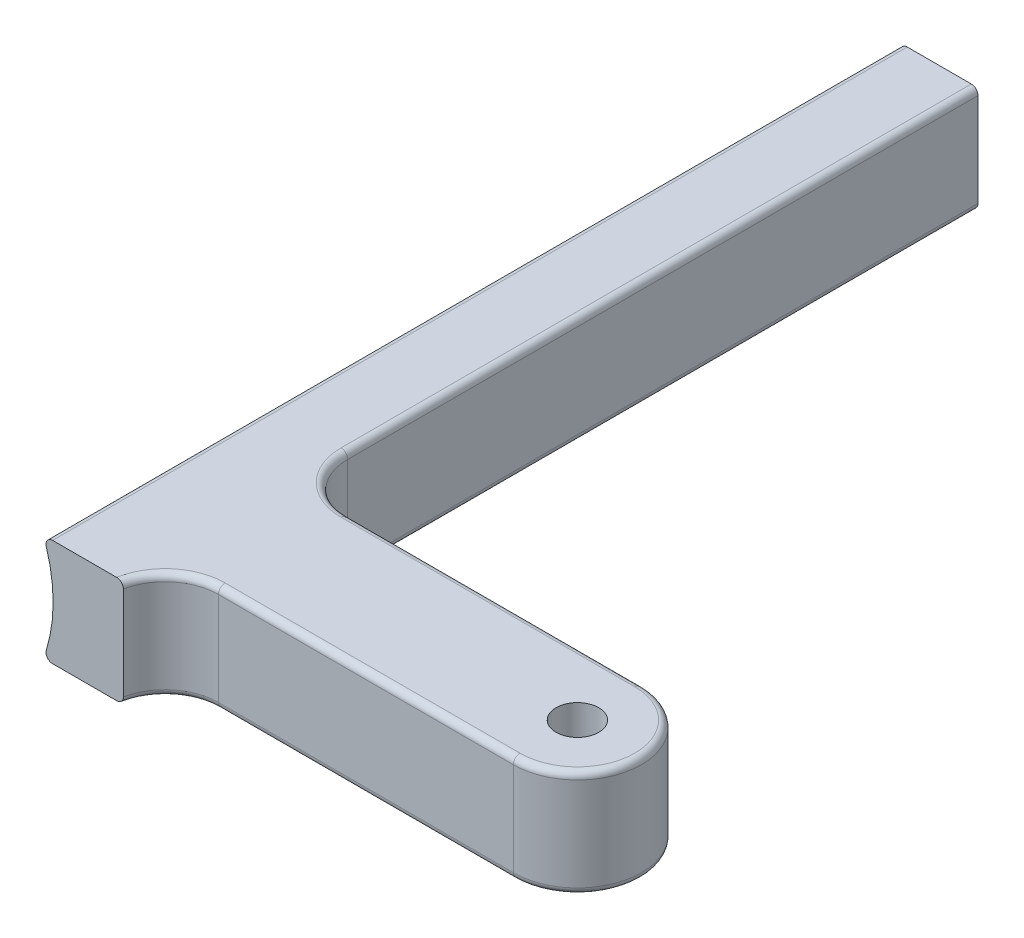
ISO-10303-21;
HEADER;
FILE_DESCRIPTION(('STEP AP214'),'2;1');
FILE_NAME('part.step','',(''),(''),'','','');
FILE_SCHEMA(('AUTOMOTIVE_DESIGN { 1 0 10303 214 1 1 1 1 }'));
ENDSEC;
DATA;
#1=APPLICATION_CONTEXT('core data for automotive mechanical design processes');
#2=APPLICATION_PROTOCOL_DEFINITION('international standard','automotive_design',2000,#1);
#3=PRODUCT_CONTEXT('',#1,'mechanical');
#4=PRODUCT('Part','Part','',(#3));
#5=PRODUCT_RELATED_PRODUCT_CATEGORY('part','',(#4));
#6=PRODUCT_DEFINITION_FORMATION('','',#4);
#7=PRODUCT_DEFINITION_CONTEXT('part definition',#1,'design');
#8=PRODUCT_DEFINITION('design','',#6,#7);
#9=PRODUCT_DEFINITION_SHAPE('','',#8);
#10=(LENGTH_UNIT() NAMED_UNIT(*) SI_UNIT(.MILLI.,.METRE.));
#11=(NAMED_UNIT(*) PLANE_ANGLE_UNIT() SI_UNIT($,.RADIAN.));
#12=(NAMED_UNIT(*) SI_UNIT($,.STERADIAN.) SOLID_ANGLE_UNIT());
#13=UNCERTAINTY_MEASURE_WITH_UNIT(LENGTH_MEASURE(1.E-05),#10,'distance_accuracy_value','');
#14=(GEOMETRIC_REPRESENTATION_CONTEXT(3) GLOBAL_UNCERTAINTY_ASSIGNED_CONTEXT((#13)) GLOBAL_UNIT_ASSIGNED_CONTEXT((#10,
#11,#12)) REPRESENTATION_CONTEXT('',''));
#15=CARTESIAN_POINT('',(0.,0.,0.));
#16=DIRECTION('',(0.,0.,1.));
#17=DIRECTION('',(1.,0.,0.));
#18=AXIS2_PLACEMENT_3D('',#15,#16,#17);
#19=CARTESIAN_POINT('',(0.,3.175,0.));
#20=DIRECTION('',(0.,1.,0.));
#21=DIRECTION('',(0.,0.,1.));
#22=AXIS2_PLACEMENT_3D('',#19,#20,#21);
#23=PLANE('',#22);
#24=CARTESIAN_POINT('',(-17.4625,3.175,-6.985));
#25=DIRECTION('',(0.,1.,0.));
#26=DIRECTION('',(0.,0.,1.));
#27=AXIS2_PLACEMENT_3D('',#24,#25,#26);
#28=CIRCLE('',#27,3.571875);
#29=CARTESIAN_POINT('',(-17.4625,3.175,-3.413125));
#30=VERTEX_POINT('',#29);
#31=CARTESIAN_POINT('',(-21.034375,3.175,-6.985));
#32=VERTEX_POINT('',#31);
#33=EDGE_CURVE('E52',#30,#32,#28,.F.);
#34=ORIENTED_EDGE('',*,*,#33,.T.);
#35=DIRECTION('',(0.,0.,-1.));
#36=VECTOR('',#35,1.);
#37=CARTESIAN_POINT('',(-21.034375,3.175,-44.45));
#38=LINE('',#37,#36);
#39=CARTESIAN_POINT('',(-21.034375,3.175,-44.45));
#40=VERTEX_POINT('',#39);
#41=EDGE_CURVE('E358',#32,#40,#38,.T.);
#42=ORIENTED_EDGE('',*,*,#41,.T.);
#43=DIRECTION('',(-1.,0.,0.));
#44=VECTOR('',#43,1.);
#45=CARTESIAN_POINT('',(-25.4,3.175,-44.45));
#46=LINE('',#45,#44);
#47=CARTESIAN_POINT('',(-24.8420960444799,3.175,-44.45));
#48=VERTEX_POINT('',#47);
#49=EDGE_CURVE('E182',#40,#48,#46,.T.);
#50=ORIENTED_EDGE('',*,*,#49,.T.);
#51=DIRECTION('',(0.,0.,-1.));
#52=VECTOR('',#51,1.);
#53=CARTESIAN_POINT('',(-24.8420960444799,3.175,6.35000000000001));
#54=LINE('',#53,#52);
#55=CARTESIAN_POINT('',(-24.8420960444799,3.175,6.35));
#56=VERTEX_POINT('',#55);
#57=EDGE_CURVE('E325',#48,#56,#54,.F.);
#58=ORIENTED_EDGE('',*,*,#57,.T.);
#59=DIRECTION('',(1.,0.,0.));
#60=VECTOR('',#59,1.);
#61=CARTESIAN_POINT('',(-20.6375,3.175,6.35));
#62=LINE('',#61,#60);
#63=CARTESIAN_POINT('',(-21.041625411461,3.175,6.35));
#64=VERTEX_POINT('',#63);
#65=EDGE_CURVE('E430',#56,#64,#62,.T.);
#66=ORIENTED_EDGE('',*,*,#65,.T.);
#67=CARTESIAN_POINT('',(-17.5266480266654,3.175,6.985));
#68=DIRECTION('',(0.,1.,0.));
#69=DIRECTION('',(0.,0.,1.));
#70=AXIS2_PLACEMENT_3D('',#67,#68,#69);
#71=CIRCLE('',#70,3.571875);
#72=CARTESIAN_POINT('',(-17.5266480266654,3.175,3.413125));
#73=VERTEX_POINT('',#72);
#74=EDGE_CURVE('E350',#64,#73,#71,.F.);
#75=ORIENTED_EDGE('',*,*,#74,.T.);
#76=DIRECTION('',(1.,0.,0.));
#77=VECTOR('',#76,1.);
#78=CARTESIAN_POINT('',(0.,3.175,3.413125));
#79=LINE('',#78,#77);
#80=CARTESIAN_POINT('',(0.,3.175,3.413125));
#81=VERTEX_POINT('',#80);
#82=EDGE_CURVE('E352',#73,#81,#79,.T.);
#83=ORIENTED_EDGE('',*,*,#82,.T.);
#84=CARTESIAN_POINT('',(0.,3.175,0.));
#85=DIRECTION('',(0.,1.,0.));
#86=DIRECTION('',(0.,0.,1.));
#87=AXIS2_PLACEMENT_3D('',#84,#85,#86);
#88=CIRCLE('',#87,3.413125);
#89=CARTESIAN_POINT('',(0.,3.175,-3.413125));
#90=VERTEX_POINT('',#89);
#91=EDGE_CURVE('E354',#81,#90,#88,.T.);
#92=ORIENTED_EDGE('',*,*,#91,.T.);
#93=DIRECTION('',(-1.,0.,0.));
#94=VECTOR('',#93,1.);
#95=CARTESIAN_POINT('',(-17.4625,3.175,-3.413125));
#96=LINE('',#95,#94);
#97=EDGE_CURVE('E57',#90,#30,#96,.T.);
#98=ORIENTED_EDGE('',*,*,#97,.T.);
#99=EDGE_LOOP('',(#34,#42,#50,#58,#66,#75,#83,#92,#98));
#100=FACE_BOUND('',#99,.T.);
#101=CARTESIAN_POINT('',(0.,3.175,0.));
#102=DIRECTION('',(0.,1.,0.));
#103=DIRECTION('',(0.,0.,1.));
#104=AXIS2_PLACEMENT_3D('',#101,#102,#103);
#105=CIRCLE('',#104,1.27);
#106=CARTESIAN_POINT('',(0.,3.175,1.27));
#107=VERTEX_POINT('',#106);
#108=EDGE_CURVE('E424',#107,#107,#105,.T.);
#109=ORIENTED_EDGE('',*,*,#108,.F.);
#110=EDGE_LOOP('',(#109));
#111=FACE_BOUND('',#110,.T.);
#112=ADVANCED_FACE('F35',(#100,#111),#23,.T.);
#113=CARTESIAN_POINT('',(0.,-3.175,0.));
#114=DIRECTION('',(0.,1.,0.));
#115=DIRECTION('',(0.,0.,1.));
#116=AXIS2_PLACEMENT_3D('',#113,#114,#115);
#117=PLANE('',#116);
#118=DIRECTION('',(1.,0.,0.));
#119=VECTOR('',#118,1.);
#120=CARTESIAN_POINT('',(0.,-3.175,3.413125));
#121=LINE('',#120,#119);
#122=CARTESIAN_POINT('',(0.,-3.175,3.413125));
#123=VERTEX_POINT('',#122);
#124=CARTESIAN_POINT('',(-17.5266480266654,-3.175,3.413125));
#125=VERTEX_POINT('',#124);
#126=EDGE_CURVE('E187',#123,#125,#121,.F.);
#127=ORIENTED_EDGE('',*,*,#126,.T.);
#128=CARTESIAN_POINT('',(-17.5266480266654,-3.175,6.985));
#129=DIRECTION('',(0.,1.,0.));
#130=DIRECTION('',(0.,0.,1.));
#131=AXIS2_PLACEMENT_3D('',#128,#129,#130);
#132=CIRCLE('',#131,3.571875);
#133=CARTESIAN_POINT('',(-21.041625411461,-3.175,6.35));
#134=VERTEX_POINT('',#133);
#135=EDGE_CURVE('E172',#125,#134,#132,.T.);
#136=ORIENTED_EDGE('',*,*,#135,.T.);
#137=DIRECTION('',(1.,0.,0.));
#138=VECTOR('',#137,1.);
#139=CARTESIAN_POINT('',(-20.6375,-3.175,6.35));
#140=LINE('',#139,#138);
#141=CARTESIAN_POINT('',(-24.8420960444799,-3.175,6.35));
#142=VERTEX_POINT('',#141);
#143=EDGE_CURVE('E164',#142,#134,#140,.T.);
#144=ORIENTED_EDGE('',*,*,#143,.F.);
#145=DIRECTION('',(0.,0.,1.));
#146=VECTOR('',#145,1.);
#147=CARTESIAN_POINT('',(-24.8420960444799,-3.175,0.));
#148=LINE('',#147,#146);
#149=CARTESIAN_POINT('',(-24.8420960444799,-3.175,-44.45));
#150=VERTEX_POINT('',#149);
#151=EDGE_CURVE('E179',#142,#150,#148,.F.);
#152=ORIENTED_EDGE('',*,*,#151,.T.);
#153=DIRECTION('',(-1.,0.,0.));
#154=VECTOR('',#153,1.);
#155=CARTESIAN_POINT('',(-25.4,-3.175,-44.45));
#156=LINE('',#155,#154);
#157=CARTESIAN_POINT('',(-21.034375,-3.175,-44.45));
#158=VERTEX_POINT('',#157);
#159=EDGE_CURVE('E183',#158,#150,#156,.T.);
#160=ORIENTED_EDGE('',*,*,#159,.F.);
#161=DIRECTION('',(0.,0.,-1.));
#162=VECTOR('',#161,1.);
#163=CARTESIAN_POINT('',(-21.034375,-3.175,0.));
#164=LINE('',#163,#162);
#165=CARTESIAN_POINT('',(-21.034375,-3.175,-6.985));
#166=VERTEX_POINT('',#165);
#167=EDGE_CURVE('E200',#158,#166,#164,.F.);
#168=ORIENTED_EDGE('',*,*,#167,.T.);
#169=CARTESIAN_POINT('',(-17.4625,-3.175,-6.985));
#170=DIRECTION('',(0.,1.,0.));
#171=DIRECTION('',(0.,0.,1.));
#172=AXIS2_PLACEMENT_3D('',#169,#170,#171);
#173=CIRCLE('',#172,3.571875);
#174=CARTESIAN_POINT('',(-17.4625,-3.175,-3.413125));
#175=VERTEX_POINT('',#174);
#176=EDGE_CURVE('E198',#166,#175,#173,.T.);
#177=ORIENTED_EDGE('',*,*,#176,.T.);
#178=DIRECTION('',(-1.,0.,0.));
#179=VECTOR('',#178,1.);
#180=CARTESIAN_POINT('',(0.,-3.175,-3.413125));
#181=LINE('',#180,#179);
#182=CARTESIAN_POINT('',(0.,-3.175,-3.413125));
#183=VERTEX_POINT('',#182);
#184=EDGE_CURVE('E196',#175,#183,#181,.F.);
#185=ORIENTED_EDGE('',*,*,#184,.T.);
#186=CARTESIAN_POINT('',(0.,-3.175,0.));
#187=DIRECTION('',(0.,1.,0.));
#188=DIRECTION('',(0.,0.,1.));
#189=AXIS2_PLACEMENT_3D('',#186,#187,#188);
#190=CIRCLE('',#189,3.413125);
#191=EDGE_CURVE('E189',#183,#123,#190,.F.);
#192=ORIENTED_EDGE('',*,*,#191,.T.);
#193=EDGE_LOOP('',(#127,#136,#144,#152,#160,#168,#177,#185,#192));
#194=FACE_BOUND('',#193,.T.);
#195=CARTESIAN_POINT('',(0.,-3.175,0.));
#196=DIRECTION('',(0.,1.,0.));
#197=DIRECTION('',(0.,0.,1.));
#198=AXIS2_PLACEMENT_3D('',#195,#196,#197);
#199=CIRCLE('',#198,1.27);
#200=CARTESIAN_POINT('',(0.,-3.175,1.27));
#201=VERTEX_POINT('',#200);
#202=EDGE_CURVE('E427',#201,#201,#199,.T.);
#203=ORIENTED_EDGE('',*,*,#202,.T.);
#204=EDGE_LOOP('',(#203));
#205=FACE_BOUND('',#204,.T.);
#206=ADVANCED_FACE('F176',(#194,#205),#117,.F.);
#207=CARTESIAN_POINT('',(0.,3.175,0.));
#208=DIRECTION('',(0.,-1.,0.));
#209=DIRECTION('',(0.,0.,-1.));
#210=AXIS2_PLACEMENT_3D('',#207,#208,#209);
#211=CYLINDRICAL_SURFACE('',#210,3.81);
#212=DIRECTION('',(0.,-1.,0.));
#213=VECTOR('',#212,1.);
#214=CARTESIAN_POINT('',(0.,3.175,3.81));
#215=LINE('',#214,#213);
#216=CARTESIAN_POINT('',(0.,2.778125,3.81));
#217=VERTEX_POINT('',#216);
#218=CARTESIAN_POINT('',(0.,-2.778125,3.81));
#219=VERTEX_POINT('',#218);
#220=EDGE_CURVE('E433',#217,#219,#215,.T.);
#221=ORIENTED_EDGE('',*,*,#220,.T.);
#222=CARTESIAN_POINT('',(0.,-2.778125,0.));
#223=DIRECTION('',(0.,1.,0.));
#224=DIRECTION('',(0.,0.,1.));
#225=AXIS2_PLACEMENT_3D('',#222,#223,#224);
#226=CIRCLE('',#225,3.81);
#227=CARTESIAN_POINT('',(0.,-2.778125,-3.81));
#228=VERTEX_POINT('',#227);
#229=EDGE_CURVE('E347',#219,#228,#226,.T.);
#230=ORIENTED_EDGE('',*,*,#229,.T.);
#231=DIRECTION('',(0.,-1.,0.));
#232=VECTOR('',#231,1.);
#233=CARTESIAN_POINT('',(0.,3.175,-3.81));
#234=LINE('',#233,#232);
#235=CARTESIAN_POINT('',(0.,2.778125,-3.81));
#236=VERTEX_POINT('',#235);
#237=EDGE_CURVE('E418',#236,#228,#234,.T.);
#238=ORIENTED_EDGE('',*,*,#237,.F.);
#239=CARTESIAN_POINT('',(0.,2.778125,0.));
#240=DIRECTION('',(0.,1.,0.));
#241=DIRECTION('',(0.,0.,1.));
#242=AXIS2_PLACEMENT_3D('',#239,#240,#241);
#243=CIRCLE('',#242,3.81);
#244=EDGE_CURVE('E345',#236,#217,#243,.F.);
#245=ORIENTED_EDGE('',*,*,#244,.T.);
#246=EDGE_LOOP('',(#221,#230,#238,#245));
#247=FACE_BOUND('',#246,.T.);
#248=ADVANCED_FACE('F240',(#247),#211,.T.);
#249=CARTESIAN_POINT('',(-20.6375,3.175,-3.81));
#250=DIRECTION('',(0.,0.,1.));
#251=DIRECTION('',(1.,0.,0.));
#252=AXIS2_PLACEMENT_3D('',#249,#250,#251);
#253=PLANE('',#252);
#254=ORIENTED_EDGE('',*,*,#237,.T.);
#255=DIRECTION('',(-1.,0.,0.));
#256=VECTOR('',#255,1.);
#257=CARTESIAN_POINT('',(-20.6375,-2.778125,-3.81));
#258=LINE('',#257,#256);
#259=CARTESIAN_POINT('',(-17.4625,-2.778125,-3.81));
#260=VERTEX_POINT('',#259);
#261=EDGE_CURVE('E343',#228,#260,#258,.T.);
#262=ORIENTED_EDGE('',*,*,#261,.T.);
#263=DIRECTION('',(0.,-1.,0.));
#264=VECTOR('',#263,1.);
#265=CARTESIAN_POINT('',(-17.4625,3.175,-3.81));
#266=LINE('',#265,#264);
#267=CARTESIAN_POINT('',(-17.4625,2.778125,-3.81));
#268=VERTEX_POINT('',#267);
#269=EDGE_CURVE('E191',#260,#268,#266,.F.);
#270=ORIENTED_EDGE('',*,*,#269,.T.);
#271=DIRECTION('',(-1.,0.,0.));
#272=VECTOR('',#271,1.);
#273=CARTESIAN_POINT('',(0.,2.778125,-3.81));
#274=LINE('',#273,#272);
#275=EDGE_CURVE('E341',#268,#236,#274,.F.);
#276=ORIENTED_EDGE('',*,*,#275,.T.);
#277=EDGE_LOOP('',(#254,#262,#270,#276));
#278=FACE_BOUND('',#277,.T.);
#279=ADVANCED_FACE('F236',(#278),#253,.F.);
#280=CARTESIAN_POINT('',(-20.6375,3.175,-44.45));
#281=DIRECTION('',(-1.,0.,0.));
#282=DIRECTION('',(0.,0.,1.));
#283=AXIS2_PLACEMENT_3D('',#280,#281,#282);
#284=PLANE('',#283);
#285=DIRECTION('',(0.,-1.,0.));
#286=VECTOR('',#285,1.);
#287=CARTESIAN_POINT('',(-20.6375,-3.175,-6.985));
#288=LINE('',#287,#286);
#289=CARTESIAN_POINT('',(-20.6375,2.778125,-6.985));
#290=VERTEX_POINT('',#289);
#291=CARTESIAN_POINT('',(-20.6375,-2.778125,-6.985));
#292=VERTEX_POINT('',#291);
#293=EDGE_CURVE('E415',#290,#292,#288,.T.);
#294=ORIENTED_EDGE('',*,*,#293,.T.);
#295=DIRECTION('',(0.,0.,-1.));
#296=VECTOR('',#295,1.);
#297=CARTESIAN_POINT('',(-20.6375,-2.778125,-44.45));
#298=LINE('',#297,#296);
#299=CARTESIAN_POINT('',(-20.6375,-2.778125,-44.45));
#300=VERTEX_POINT('',#299);
#301=EDGE_CURVE('E332',#292,#300,#298,.T.);
#302=ORIENTED_EDGE('',*,*,#301,.T.);
#303=DIRECTION('',(0.,-1.,0.));
#304=VECTOR('',#303,1.);
#305=CARTESIAN_POINT('',(-20.6375,3.175,-44.45));
#306=LINE('',#305,#304);
#307=CARTESIAN_POINT('',(-20.6375,2.778125,-44.45));
#308=VERTEX_POINT('',#307);
#309=EDGE_CURVE('E412',#308,#300,#306,.T.);
#310=ORIENTED_EDGE('',*,*,#309,.F.);
#311=DIRECTION('',(0.,0.,-1.));
#312=VECTOR('',#311,1.);
#313=CARTESIAN_POINT('',(-20.6375,2.778125,-6.985));
#314=LINE('',#313,#312);
#315=EDGE_CURVE('E405',#308,#290,#314,.F.);
#316=ORIENTED_EDGE('',*,*,#315,.T.);
#317=EDGE_LOOP('',(#294,#302,#310,#316));
#318=FACE_BOUND('',#317,.T.);
#319=ADVANCED_FACE('F232',(#318),#284,.F.);
#320=CARTESIAN_POINT('',(-25.4,3.175,-44.45));
#321=DIRECTION('',(0.,0.,1.));
#322=DIRECTION('',(1.,0.,0.));
#323=AXIS2_PLACEMENT_3D('',#320,#321,#322);
#324=PLANE('',#323);
#325=ORIENTED_EDGE('',*,*,#309,.T.);
#326=CARTESIAN_POINT('',(-21.034375,-2.778125,-44.45));
#327=DIRECTION('',(0.,0.,1.));
#328=DIRECTION('',(1.,0.,0.));
#329=AXIS2_PLACEMENT_3D('',#326,#327,#328);
#330=CIRCLE('',#329,0.396875);
#331=EDGE_CURVE('E330',#300,#158,#330,.F.);
#332=ORIENTED_EDGE('',*,*,#331,.T.);
#333=ORIENTED_EDGE('',*,*,#159,.T.);
#334=CARTESIAN_POINT('',(-24.8420960444799,-2.778125,-44.45));
#335=DIRECTION('',(0.,0.,1.));
#336=DIRECTION('',(1.,0.,0.));
#337=AXIS2_PLACEMENT_3D('',#334,#335,#336);
#338=CIRCLE('',#337,0.396875);
#339=CARTESIAN_POINT('',(-25.2207971745212,-2.65940170940171,-44.45));
#340=VERTEX_POINT('',#339);
#341=EDGE_CURVE('E186',#150,#340,#338,.F.);
#342=ORIENTED_EDGE('',*,*,#341,.T.);
#343=CARTESIAN_POINT('',(-33.703702487445,0.,-44.45));
#344=DIRECTION('',(0.,0.,1.));
#345=DIRECTION('',(1.,0.,0.));
#346=AXIS2_PLACEMENT_3D('',#343,#344,#345);
#347=CIRCLE('',#346,8.89);
#348=CARTESIAN_POINT('',(-25.2207971745212,2.65940170940171,-44.45));
#349=VERTEX_POINT('',#348);
#350=EDGE_CURVE('E380',#340,#349,#347,.T.);
#351=ORIENTED_EDGE('',*,*,#350,.T.);
#352=CARTESIAN_POINT('',(-24.8420960444799,2.778125,-44.45));
#353=DIRECTION('',(0.,0.,1.));
#354=DIRECTION('',(1.,0.,0.));
#355=AXIS2_PLACEMENT_3D('',#352,#353,#354);
#356=CIRCLE('',#355,0.396875);
#357=EDGE_CURVE('E324',#349,#48,#356,.F.);
#358=ORIENTED_EDGE('',*,*,#357,.T.);
#359=ORIENTED_EDGE('',*,*,#49,.F.);
#360=CARTESIAN_POINT('',(-21.034375,2.778125,-44.45));
#361=DIRECTION('',(0.,0.,1.));
#362=DIRECTION('',(1.,0.,0.));
#363=AXIS2_PLACEMENT_3D('',#360,#361,#362);
#364=CIRCLE('',#363,0.396875);
#365=EDGE_CURVE('E328',#40,#308,#364,.F.);
#366=ORIENTED_EDGE('',*,*,#365,.T.);
#367=EDGE_LOOP('',(#325,#332,#333,#342,#351,#358,#359,#366));
#368=FACE_BOUND('',#367,.T.);
#369=ADVANCED_FACE('F227',(#368),#324,.F.);
#370=CARTESIAN_POINT('',(-20.6375,3.175,6.35));
#371=DIRECTION('',(0.,0.,-1.));
#372=DIRECTION('',(-1.,0.,0.));
#373=AXIS2_PLACEMENT_3D('',#370,#371,#372);
#374=PLANE('',#373);
#375=ORIENTED_EDGE('',*,*,#143,.T.);
#376=CARTESIAN_POINT('',(-21.041625411461,-3.175,6.35));
#377=CARTESIAN_POINT('',(-21.0186083999145,-3.17501746898151,6.35));
#378=CARTESIAN_POINT('',(-20.9955961736406,-3.17306194464823,6.35));
#379=CARTESIAN_POINT('',(-20.950228642666,-3.16533993436367,6.35));
#380=CARTESIAN_POINT('',(-20.9278730899066,-3.15957490730453,6.35));
#381=CARTESIAN_POINT('',(-20.8844355168877,-3.14436447267857,6.35));
#382=CARTESIAN_POINT('',(-20.8633542158926,-3.13491700852188,6.35));
#383=CARTESIAN_POINT('',(-20.8230938323256,-3.11260029572224,6.35));
#384=CARTESIAN_POINT('',(-20.8039142442841,-3.09973195970218,6.35));
#385=CARTESIAN_POINT('',(-20.7681295473009,-3.07100247897071,6.35));
#386=CARTESIAN_POINT('',(-20.7515099690164,-3.05515936956564,6.35));
#387=CARTESIAN_POINT('',(-20.7212176334895,-3.02086141990338,6.35));
#388=CARTESIAN_POINT('',(-20.7075453093697,-3.00240619643439,6.35));
#389=CARTESIAN_POINT('',(-20.6837877056586,-2.96373698022506,6.35));
#390=CARTESIAN_POINT('',(-20.6736470020273,-2.94355700148628,6.35));
#391=CARTESIAN_POINT('',(-20.6569767646911,-2.90176512725773,6.35));
#392=CARTESIAN_POINT('',(-20.6504440739252,-2.88015450220791,6.35));
#393=CARTESIAN_POINT('',(-20.6430555458794,-2.8449993962359,6.35));
#394=CARTESIAN_POINT('',(-20.6409735031402,-2.83170075676754,6.35));
#395=CARTESIAN_POINT('',(-20.6381960778249,-2.80497853510684,6.35));
#396=CARTESIAN_POINT('',(-20.6374987375975,-2.79155515629953,6.35));
#397=CARTESIAN_POINT('',(-20.6374999999995,-2.77812500000011,6.35));
#398=B_SPLINE_CURVE_WITH_KNOTS('',3,(#376,#377,#378,#379,#380,#381,#382,#383,#384,#385,#386,
#387,#388,#389,#390,#391,#392,#393,#394,#395,#396,#397),.UNSPECIFIED.,.F.,.F.,(4,2,2,2,2,2,2,2,
2,2,4),(0.,0.0689616646806386,0.13789693500566,0.206870760010136,0.27582620255717,
0.344376347724116,0.412936560026809,0.480366401221727,0.547737146520678,0.588053337724881,
0.628312490397845),.UNSPECIFIED.);
#399=CARTESIAN_POINT('',(-20.6375,-2.778125,6.35));
#400=VERTEX_POINT('',#399);
#401=EDGE_CURVE('E212',#134,#400,#398,.T.);
#402=ORIENTED_EDGE('',*,*,#401,.T.);
#403=DIRECTION('',(0.,-1.,0.));
#404=VECTOR('',#403,1.);
#405=CARTESIAN_POINT('',(-20.6375,3.175,6.35));
#406=LINE('',#405,#404);
#407=CARTESIAN_POINT('',(-20.6375,2.778125,6.35));
#408=VERTEX_POINT('',#407);
#409=EDGE_CURVE('E419',#408,#400,#406,.T.);
#410=ORIENTED_EDGE('',*,*,#409,.F.);
#411=CARTESIAN_POINT('',(-20.6375,2.778125,6.35));
#412=CARTESIAN_POINT('',(-20.6374789591016,2.80013841562376,6.35));
#413=CARTESIAN_POINT('',(-20.6393679633644,2.82214318644541,6.35));
#414=CARTESIAN_POINT('',(-20.6468071208903,2.86549462514758,6.35));
#415=CARTESIAN_POINT('',(-20.652352161963,2.88684216845702,6.35));
#416=CARTESIAN_POINT('',(-20.6669471577444,2.92830857272228,6.35));
#417=CARTESIAN_POINT('',(-20.6759980249002,2.94842711223083,6.35));
#418=CARTESIAN_POINT('',(-20.6973160283344,2.9868783375422,6.35));
#419=CARTESIAN_POINT('',(-20.7095831719324,3.00521101928061,6.35));
#420=CARTESIAN_POINT('',(-20.7370977753813,3.03976672860655,6.35));
#421=CARTESIAN_POINT('',(-20.7523722197509,3.0559682578314,6.35));
#422=CARTESIAN_POINT('',(-20.7853825193225,3.08563736158705,6.35));
#423=CARTESIAN_POINT('',(-20.803118956993,3.09910428729171,6.35));
#424=CARTESIAN_POINT('',(-20.840903889295,3.12318455309765,6.35));
#425=CARTESIAN_POINT('',(-20.8609896040834,3.13373944058369,6.35));
#426=CARTESIAN_POINT('',(-20.9026269759598,3.15137997658816,6.35));
#427=CARTESIAN_POINT('',(-20.9241780835588,3.15846691742555,6.35));
#428=CARTESIAN_POINT('',(-20.9617857607886,3.16747283868245,6.35));
#429=CARTESIAN_POINT('',(-20.9776327748286,3.17029306617633,6.35));
#430=CARTESIAN_POINT('',(-21.0095263468325,3.17405666661809,6.35));
#431=CARTESIAN_POINT('',(-21.0255726064021,3.175002569174,6.35));
#432=CARTESIAN_POINT('',(-21.041625411461,3.175,6.35));
#433=B_SPLINE_CURVE_WITH_KNOTS('',3,(#411,#412,#413,#414,#415,#416,#417,#418,#419,#420,#421,
#422,#423,#424,#425,#426,#427,#428,#429,#430,#431,#432),.UNSPECIFIED.,.F.,.F.,(4,2,2,2,2,2,2,2,
2,2,4),(0.,0.065946398134892,0.131800779254855,0.197672311556338,0.263543993770446,
0.330036150858776,0.396544065832871,0.464303229325681,0.532037123323216,0.580220203447281,
0.628338210784812),.UNSPECIFIED.);
#434=EDGE_CURVE('E204',#408,#64,#433,.T.);
#435=ORIENTED_EDGE('',*,*,#434,.T.);
#436=ORIENTED_EDGE('',*,*,#65,.F.);
#437=CARTESIAN_POINT('',(-24.8420960444799,2.778125,6.35));
#438=DIRECTION('',(0.,0.,-1.));
#439=DIRECTION('',(-1.,0.,0.));
#440=AXIS2_PLACEMENT_3D('',#437,#438,#439);
#441=CIRCLE('',#440,0.396875);
#442=CARTESIAN_POINT('',(-25.2207971745212,2.65940170940171,6.35));
#443=VERTEX_POINT('',#442);
#444=EDGE_CURVE('E171',#56,#443,#441,.F.);
#445=ORIENTED_EDGE('',*,*,#444,.T.);
#446=CARTESIAN_POINT('',(-33.703702487445,0.,6.35000000000001));
#447=DIRECTION('',(0.,0.,-1.));
#448=DIRECTION('',(-1.,0.,0.));
#449=AXIS2_PLACEMENT_3D('',#446,#447,#448);
#450=CIRCLE('',#449,8.89);
#451=CARTESIAN_POINT('',(-25.2207971745212,-2.65940170940171,6.35));
#452=VERTEX_POINT('',#451);
#453=EDGE_CURVE('E166',#443,#452,#450,.T.);
#454=ORIENTED_EDGE('',*,*,#453,.T.);
#455=CARTESIAN_POINT('',(-24.8420960444799,-2.778125,6.35));
#456=DIRECTION('',(0.,0.,-1.));
#457=DIRECTION('',(-1.,0.,0.));
#458=AXIS2_PLACEMENT_3D('',#455,#456,#457);
#459=CIRCLE('',#458,0.396875);
#460=EDGE_CURVE('E161',#452,#142,#459,.F.);
#461=ORIENTED_EDGE('',*,*,#460,.T.);
#462=EDGE_LOOP('',(#375,#402,#410,#435,#436,#445,#454,#461));
#463=FACE_BOUND('',#462,.T.);
#464=ADVANCED_FACE('F163',(#463),#374,.F.);
#465=CARTESIAN_POINT('',(-20.6375,3.175,3.81));
#466=DIRECTION('',(0.,0.,-1.));
#467=DIRECTION('',(-1.,0.,0.));
#468=AXIS2_PLACEMENT_3D('',#465,#466,#467);
#469=PLANE('',#468);
#470=ORIENTED_EDGE('',*,*,#220,.F.);
#471=DIRECTION('',(1.,0.,0.));
#472=VECTOR('',#471,1.);
#473=CARTESIAN_POINT('',(-17.5266480266654,2.778125,3.81));
#474=LINE('',#473,#472);
#475=CARTESIAN_POINT('',(-17.5266480266654,2.778125,3.81));
#476=VERTEX_POINT('',#475);
#477=EDGE_CURVE('E362',#217,#476,#474,.F.);
#478=ORIENTED_EDGE('',*,*,#477,.T.);
#479=DIRECTION('',(0.,-1.,0.));
#480=VECTOR('',#479,1.);
#481=CARTESIAN_POINT('',(-17.5266480266654,3.175,3.81));
#482=LINE('',#481,#480);
#483=CARTESIAN_POINT('',(-17.5266480266654,-2.778125,3.81));
#484=VERTEX_POINT('',#483);
#485=EDGE_CURVE('E439',#476,#484,#482,.T.);
#486=ORIENTED_EDGE('',*,*,#485,.T.);
#487=DIRECTION('',(1.,0.,0.));
#488=VECTOR('',#487,1.);
#489=CARTESIAN_POINT('',(-20.6375,-2.778125,3.81));
#490=LINE('',#489,#488);
#491=EDGE_CURVE('E360',#484,#219,#490,.T.);
#492=ORIENTED_EDGE('',*,*,#491,.T.);
#493=EDGE_LOOP('',(#470,#478,#486,#492));
#494=FACE_BOUND('',#493,.T.);
#495=ADVANCED_FACE('F226',(#494),#469,.F.);
#496=CARTESIAN_POINT('',(0.,3.175,0.));
#497=DIRECTION('',(0.,-1.,0.));
#498=DIRECTION('',(0.,0.,-1.));
#499=AXIS2_PLACEMENT_3D('',#496,#497,#498);
#500=CYLINDRICAL_SURFACE('',#499,1.27);
#501=ORIENTED_EDGE('',*,*,#108,.T.);
#502=EDGE_LOOP('',(#501));
#503=FACE_BOUND('',#502,.T.);
#504=ORIENTED_EDGE('',*,*,#202,.F.);
#505=EDGE_LOOP('',(#504));
#506=FACE_BOUND('',#505,.T.);
#507=ADVANCED_FACE('F249',(#503,#506),#500,.F.);
#508=CARTESIAN_POINT('',(-17.5266480266654,3.175,6.985));
#509=DIRECTION('',(0.,-1.,0.));
#510=DIRECTION('',(0.,0.,-1.));
#511=AXIS2_PLACEMENT_3D('',#508,#509,#510);
#512=CYLINDRICAL_SURFACE('',#511,3.175);
#513=ORIENTED_EDGE('',*,*,#409,.T.);
#514=CARTESIAN_POINT('',(-17.5266480266654,-2.778125,6.985));
#515=DIRECTION('',(0.,1.,0.));
#516=DIRECTION('',(0.,0.,1.));
#517=AXIS2_PLACEMENT_3D('',#514,#515,#516);
#518=CIRCLE('',#517,3.175);
#519=EDGE_CURVE('E404',#400,#484,#518,.F.);
#520=ORIENTED_EDGE('',*,*,#519,.T.);
#521=ORIENTED_EDGE('',*,*,#485,.F.);
#522=CARTESIAN_POINT('',(-17.5266480266654,2.778125,6.985));
#523=DIRECTION('',(0.,1.,0.));
#524=DIRECTION('',(0.,0.,1.));
#525=AXIS2_PLACEMENT_3D('',#522,#523,#524);
#526=CIRCLE('',#525,3.175);
#527=EDGE_CURVE('E400',#476,#408,#526,.T.);
#528=ORIENTED_EDGE('',*,*,#527,.T.);
#529=EDGE_LOOP('',(#513,#520,#521,#528));
#530=FACE_BOUND('',#529,.T.);
#531=ADVANCED_FACE('F245',(#530),#512,.F.);
#532=CARTESIAN_POINT('',(-17.4625,3.175,-6.985));
#533=DIRECTION('',(0.,1.,0.));
#534=DIRECTION('',(0.,0.,1.));
#535=AXIS2_PLACEMENT_3D('',#532,#533,#534);
#536=CYLINDRICAL_SURFACE('',#535,3.175);
#537=ORIENTED_EDGE('',*,*,#269,.F.);
#538=CARTESIAN_POINT('',(-17.4625,-2.778125,-6.985));
#539=DIRECTION('',(0.,1.,0.));
#540=DIRECTION('',(0.,0.,1.));
#541=AXIS2_PLACEMENT_3D('',#538,#539,#540);
#542=CIRCLE('',#541,3.175);
#543=EDGE_CURVE('E339',#260,#292,#542,.F.);
#544=ORIENTED_EDGE('',*,*,#543,.T.);
#545=ORIENTED_EDGE('',*,*,#293,.F.);
#546=CARTESIAN_POINT('',(-17.4625,2.778125,-6.985));
#547=DIRECTION('',(0.,1.,0.));
#548=DIRECTION('',(0.,0.,1.));
#549=AXIS2_PLACEMENT_3D('',#546,#547,#548);
#550=CIRCLE('',#549,3.175);
#551=EDGE_CURVE('E337',#290,#268,#550,.T.);
#552=ORIENTED_EDGE('',*,*,#551,.T.);
#553=EDGE_LOOP('',(#537,#544,#545,#552));
#554=FACE_BOUND('',#553,.T.);
#555=ADVANCED_FACE('F248',(#554),#536,.F.);
#556=CARTESIAN_POINT('',(-33.703702487445,0.,-44.45));
#557=DIRECTION('',(0.,0.,1.));
#558=DIRECTION('',(1.,0.,0.));
#559=AXIS2_PLACEMENT_3D('',#556,#557,#558);
#560=CYLINDRICAL_SURFACE('',#559,8.89);
#561=ORIENTED_EDGE('',*,*,#453,.F.);
#562=DIRECTION('',(0.,0.,1.));
#563=VECTOR('',#562,1.);
#564=CARTESIAN_POINT('',(-25.2207971745212,2.65940170940171,-44.45));
#565=LINE('',#564,#563);
#566=EDGE_CURVE('E11',#443,#349,#565,.F.);
#567=ORIENTED_EDGE('',*,*,#566,.T.);
#568=ORIENTED_EDGE('',*,*,#350,.F.);
#569=DIRECTION('',(0.,0.,1.));
#570=VECTOR('',#569,1.);
#571=CARTESIAN_POINT('',(-25.2207971745212,-2.65940170940171,-44.45));
#572=LINE('',#571,#570);
#573=EDGE_CURVE('E44',#340,#452,#572,.T.);
#574=ORIENTED_EDGE('',*,*,#573,.T.);
#575=EDGE_LOOP('',(#561,#567,#568,#574));
#576=FACE_BOUND('',#575,.T.);
#577=ADVANCED_FACE('F252',(#576),#560,.F.);
#578=CARTESIAN_POINT('',(-21.034375,-2.778125,-44.45));
#579=DIRECTION('',(0.,0.,-1.));
#580=DIRECTION('',(-1.,0.,0.));
#581=AXIS2_PLACEMENT_3D('',#578,#579,#580);
#582=CYLINDRICAL_SURFACE('',#581,0.396875);
#583=ORIENTED_EDGE('',*,*,#331,.F.);
#584=ORIENTED_EDGE('',*,*,#301,.F.);
#585=CARTESIAN_POINT('',(-21.034375,-2.778125,-6.985));
#586=DIRECTION('',(0.,0.,1.));
#587=DIRECTION('',(1.,0.,0.));
#588=AXIS2_PLACEMENT_3D('',#585,#586,#587);
#589=CIRCLE('',#588,0.396875);
#590=EDGE_CURVE('E377',#166,#292,#589,.T.);
#591=ORIENTED_EDGE('',*,*,#590,.F.);
#592=ORIENTED_EDGE('',*,*,#167,.F.);
#593=EDGE_LOOP('',(#583,#584,#591,#592));
#594=FACE_BOUND('',#593,.T.);
#595=ADVANCED_FACE('F274',(#594),#582,.T.);
#596=CARTESIAN_POINT('',(-17.4625,-2.778125,-6.985));
#597=DIRECTION('',(0.,1.,0.));
#598=DIRECTION('',(0.,0.,1.));
#599=AXIS2_PLACEMENT_3D('',#596,#597,#598);
#600=TOROIDAL_SURFACE('',#599,3.571875,0.396875);
#601=ORIENTED_EDGE('',*,*,#590,.T.);
#602=ORIENTED_EDGE('',*,*,#543,.F.);
#603=CARTESIAN_POINT('',(-17.4625,-2.778125,-3.413125));
#604=DIRECTION('',(1.,0.,0.));
#605=DIRECTION('',(0.,0.,-1.));
#606=AXIS2_PLACEMENT_3D('',#603,#604,#605);
#607=CIRCLE('',#606,0.396875);
#608=EDGE_CURVE('E374',#175,#260,#607,.T.);
#609=ORIENTED_EDGE('',*,*,#608,.F.);
#610=ORIENTED_EDGE('',*,*,#176,.F.);
#611=EDGE_LOOP('',(#601,#602,#609,#610));
#612=FACE_BOUND('',#611,.T.);
#613=ADVANCED_FACE('F270',(#612),#600,.T.);
#614=CARTESIAN_POINT('',(-20.6375,-2.778125,-3.413125));
#615=DIRECTION('',(-1.,0.,0.));
#616=DIRECTION('',(0.,0.,1.));
#617=AXIS2_PLACEMENT_3D('',#614,#615,#616);
#618=CYLINDRICAL_SURFACE('',#617,0.396875);
#619=ORIENTED_EDGE('',*,*,#608,.T.);
#620=ORIENTED_EDGE('',*,*,#261,.F.);
#621=CARTESIAN_POINT('',(0.,-2.778125,-3.413125));
#622=DIRECTION('',(1.,0.,0.));
#623=DIRECTION('',(0.,0.,-1.));
#624=AXIS2_PLACEMENT_3D('',#621,#622,#623);
#625=CIRCLE('',#624,0.396875);
#626=EDGE_CURVE('E371',#183,#228,#625,.T.);
#627=ORIENTED_EDGE('',*,*,#626,.F.);
#628=ORIENTED_EDGE('',*,*,#184,.F.);
#629=EDGE_LOOP('',(#619,#620,#627,#628));
#630=FACE_BOUND('',#629,.T.);
#631=ADVANCED_FACE('F266',(#630),#618,.T.);
#632=CARTESIAN_POINT('',(0.,-2.778125,0.));
#633=DIRECTION('',(0.,1.,0.));
#634=DIRECTION('',(0.,0.,1.));
#635=AXIS2_PLACEMENT_3D('',#632,#633,#634);
#636=TOROIDAL_SURFACE('',#635,3.413125,0.396875);
#637=ORIENTED_EDGE('',*,*,#626,.T.);
#638=ORIENTED_EDGE('',*,*,#229,.F.);
#639=CARTESIAN_POINT('',(0.,-2.778125,3.413125));
#640=DIRECTION('',(-1.,0.,0.));
#641=DIRECTION('',(0.,0.,1.));
#642=AXIS2_PLACEMENT_3D('',#639,#640,#641);
#643=CIRCLE('',#642,0.396875);
#644=EDGE_CURVE('E368',#123,#219,#643,.T.);
#645=ORIENTED_EDGE('',*,*,#644,.F.);
#646=ORIENTED_EDGE('',*,*,#191,.F.);
#647=EDGE_LOOP('',(#637,#638,#645,#646));
#648=FACE_BOUND('',#647,.T.);
#649=ADVANCED_FACE('F262',(#648),#636,.T.);
#650=CARTESIAN_POINT('',(-20.6375,-2.778125,3.413125));
#651=DIRECTION('',(1.,0.,0.));
#652=DIRECTION('',(0.,0.,-1.));
#653=AXIS2_PLACEMENT_3D('',#650,#651,#652);
#654=CYLINDRICAL_SURFACE('',#653,0.396875);
#655=ORIENTED_EDGE('',*,*,#644,.T.);
#656=ORIENTED_EDGE('',*,*,#491,.F.);
#657=CARTESIAN_POINT('',(-17.5266480266654,-2.778125,3.413125));
#658=DIRECTION('',(-1.,0.,0.));
#659=DIRECTION('',(0.,0.,1.));
#660=AXIS2_PLACEMENT_3D('',#657,#658,#659);
#661=CIRCLE('',#660,0.396875);
#662=EDGE_CURVE('E365',#125,#484,#661,.T.);
#663=ORIENTED_EDGE('',*,*,#662,.F.);
#664=ORIENTED_EDGE('',*,*,#126,.F.);
#665=EDGE_LOOP('',(#655,#656,#663,#664));
#666=FACE_BOUND('',#665,.T.);
#667=ADVANCED_FACE('F258',(#666),#654,.T.);
#668=CARTESIAN_POINT('',(-17.5266480266654,-2.778125,6.985));
#669=DIRECTION('',(0.,1.,0.));
#670=DIRECTION('',(0.,0.,1.));
#671=AXIS2_PLACEMENT_3D('',#668,#669,#670);
#672=TOROIDAL_SURFACE('',#671,3.571875,0.396875);
#673=ORIENTED_EDGE('',*,*,#662,.T.);
#674=ORIENTED_EDGE('',*,*,#519,.F.);
#675=ORIENTED_EDGE('',*,*,#401,.F.);
#676=ORIENTED_EDGE('',*,*,#135,.F.);
#677=EDGE_LOOP('',(#673,#674,#675,#676));
#678=FACE_BOUND('',#677,.T.);
#679=ADVANCED_FACE('F254',(#678),#672,.T.);
#680=CARTESIAN_POINT('',(-17.5266480266654,2.778125,6.985));
#681=DIRECTION('',(0.,1.,0.));
#682=DIRECTION('',(0.,0.,1.));
#683=AXIS2_PLACEMENT_3D('',#680,#681,#682);
#684=TOROIDAL_SURFACE('',#683,3.571875,0.396875);
#685=ORIENTED_EDGE('',*,*,#434,.F.);
#686=ORIENTED_EDGE('',*,*,#527,.F.);
#687=CARTESIAN_POINT('',(-17.5266480266654,2.778125,3.413125));
#688=DIRECTION('',(1.,0.,0.));
#689=DIRECTION('',(0.,0.,-1.));
#690=AXIS2_PLACEMENT_3D('',#687,#688,#689);
#691=CIRCLE('',#690,0.396875);
#692=EDGE_CURVE('E39',#73,#476,#691,.T.);
#693=ORIENTED_EDGE('',*,*,#692,.F.);
#694=ORIENTED_EDGE('',*,*,#74,.F.);
#695=EDGE_LOOP('',(#685,#686,#693,#694));
#696=FACE_BOUND('',#695,.T.);
#697=ADVANCED_FACE('F219',(#696),#684,.T.);
#698=CARTESIAN_POINT('',(0.,2.778125,3.413125));
#699=DIRECTION('',(-1.,0.,0.));
#700=DIRECTION('',(0.,0.,1.));
#701=AXIS2_PLACEMENT_3D('',#698,#699,#700);
#702=CYLINDRICAL_SURFACE('',#701,0.396875);
#703=ORIENTED_EDGE('',*,*,#692,.T.);
#704=ORIENTED_EDGE('',*,*,#477,.F.);
#705=CARTESIAN_POINT('',(0.,2.778125,3.413125));
#706=DIRECTION('',(1.,0.,0.));
#707=DIRECTION('',(0.,0.,-1.));
#708=AXIS2_PLACEMENT_3D('',#705,#706,#707);
#709=CIRCLE('',#708,0.396875);
#710=EDGE_CURVE('E389',#81,#217,#709,.T.);
#711=ORIENTED_EDGE('',*,*,#710,.F.);
#712=ORIENTED_EDGE('',*,*,#82,.F.);
#713=EDGE_LOOP('',(#703,#704,#711,#712));
#714=FACE_BOUND('',#713,.T.);
#715=ADVANCED_FACE('F294',(#714),#702,.T.);
#716=CARTESIAN_POINT('',(0.,2.778125,0.));
#717=DIRECTION('',(0.,1.,0.));
#718=DIRECTION('',(0.,0.,1.));
#719=AXIS2_PLACEMENT_3D('',#716,#717,#718);
#720=TOROIDAL_SURFACE('',#719,3.413125,0.396875);
#721=ORIENTED_EDGE('',*,*,#710,.T.);
#722=ORIENTED_EDGE('',*,*,#244,.F.);
#723=CARTESIAN_POINT('',(0.,2.778125,-3.413125));
#724=DIRECTION('',(-1.,0.,0.));
#725=DIRECTION('',(0.,0.,1.));
#726=AXIS2_PLACEMENT_3D('',#723,#724,#725);
#727=CIRCLE('',#726,0.396875);
#728=EDGE_CURVE('E387',#90,#236,#727,.T.);
#729=ORIENTED_EDGE('',*,*,#728,.F.);
#730=ORIENTED_EDGE('',*,*,#91,.F.);
#731=EDGE_LOOP('',(#721,#722,#729,#730));
#732=FACE_BOUND('',#731,.T.);
#733=ADVANCED_FACE('F291',(#732),#720,.T.);
#734=CARTESIAN_POINT('',(0.,2.778125,-3.413125));
#735=DIRECTION('',(1.,0.,0.));
#736=DIRECTION('',(0.,0.,-1.));
#737=AXIS2_PLACEMENT_3D('',#734,#735,#736);
#738=CYLINDRICAL_SURFACE('',#737,0.396875);
#739=ORIENTED_EDGE('',*,*,#728,.T.);
#740=ORIENTED_EDGE('',*,*,#275,.F.);
#741=CARTESIAN_POINT('',(-17.4625,2.778125,-3.413125));
#742=DIRECTION('',(-1.,0.,0.));
#743=DIRECTION('',(0.,0.,1.));
#744=AXIS2_PLACEMENT_3D('',#741,#742,#743);
#745=CIRCLE('',#744,0.396875);
#746=EDGE_CURVE('E384',#30,#268,#745,.T.);
#747=ORIENTED_EDGE('',*,*,#746,.F.);
#748=ORIENTED_EDGE('',*,*,#97,.F.);
#749=EDGE_LOOP('',(#739,#740,#747,#748));
#750=FACE_BOUND('',#749,.T.);
#751=ADVANCED_FACE('F287',(#750),#738,.T.);
#752=CARTESIAN_POINT('',(-17.4625,2.778125,-6.985));
#753=DIRECTION('',(0.,1.,0.));
#754=DIRECTION('',(0.,0.,1.));
#755=AXIS2_PLACEMENT_3D('',#752,#753,#754);
#756=TOROIDAL_SURFACE('',#755,3.571875,0.396875);
#757=ORIENTED_EDGE('',*,*,#746,.T.);
#758=ORIENTED_EDGE('',*,*,#551,.F.);
#759=CARTESIAN_POINT('',(-21.034375,2.778125,-6.985));
#760=DIRECTION('',(0.,0.,-1.));
#761=DIRECTION('',(-1.,0.,0.));
#762=AXIS2_PLACEMENT_3D('',#759,#760,#761);
#763=CIRCLE('',#762,0.396875);
#764=EDGE_CURVE('E381',#32,#290,#763,.T.);
#765=ORIENTED_EDGE('',*,*,#764,.F.);
#766=ORIENTED_EDGE('',*,*,#33,.F.);
#767=EDGE_LOOP('',(#757,#758,#765,#766));
#768=FACE_BOUND('',#767,.T.);
#769=ADVANCED_FACE('F283',(#768),#756,.T.);
#770=CARTESIAN_POINT('',(-21.034375,2.778125,0.));
#771=DIRECTION('',(0.,0.,1.));
#772=DIRECTION('',(1.,0.,0.));
#773=AXIS2_PLACEMENT_3D('',#770,#771,#772);
#774=CYLINDRICAL_SURFACE('',#773,0.396875);
#775=ORIENTED_EDGE('',*,*,#764,.T.);
#776=ORIENTED_EDGE('',*,*,#315,.F.);
#777=ORIENTED_EDGE('',*,*,#365,.F.);
#778=ORIENTED_EDGE('',*,*,#41,.F.);
#779=EDGE_LOOP('',(#775,#776,#777,#778));
#780=FACE_BOUND('',#779,.T.);
#781=ADVANCED_FACE('F279',(#780),#774,.T.);
#782=CARTESIAN_POINT('',(-24.8420960444799,2.778125,-44.45));
#783=DIRECTION('',(0.,0.,1.));
#784=DIRECTION('',(1.,0.,0.));
#785=AXIS2_PLACEMENT_3D('',#782,#783,#784);
#786=CYLINDRICAL_SURFACE('',#785,0.396875);
#787=ORIENTED_EDGE('',*,*,#357,.F.);
#788=ORIENTED_EDGE('',*,*,#566,.F.);
#789=ORIENTED_EDGE('',*,*,#444,.F.);
#790=ORIENTED_EDGE('',*,*,#57,.F.);
#791=EDGE_LOOP('',(#787,#788,#789,#790));
#792=FACE_BOUND('',#791,.T.);
#793=ADVANCED_FACE('F282',(#792),#786,.T.);
#794=CARTESIAN_POINT('',(-24.8420960444799,-2.778125,-44.45));
#795=DIRECTION('',(0.,0.,1.));
#796=DIRECTION('',(1.,0.,0.));
#797=AXIS2_PLACEMENT_3D('',#794,#795,#796);
#798=CYLINDRICAL_SURFACE('',#797,0.396875);
#799=ORIENTED_EDGE('',*,*,#341,.F.);
#800=ORIENTED_EDGE('',*,*,#151,.F.);
#801=ORIENTED_EDGE('',*,*,#460,.F.);
#802=ORIENTED_EDGE('',*,*,#573,.F.);
#803=EDGE_LOOP('',(#799,#800,#801,#802));
#804=FACE_BOUND('',#803,.T.);
#805=ADVANCED_FACE('F37',(#804),#798,.T.);
#806=CLOSED_SHELL('',(#112,#206,#248,#279,#319,#369,#464,#495,#507,#531,#555,#577,#595,#613,
#631,#649,#667,#679,#697,#715,#733,#751,#769,#781,#793,#805));
#807=MANIFOLD_SOLID_BREP('B2',#806);
#808=ADVANCED_BREP_SHAPE_REPRESENTATION('',(#18,#807),#14);
#809=SHAPE_DEFINITION_REPRESENTATION(#9,#808);
ENDSEC;
END-ISO-10303-21;
